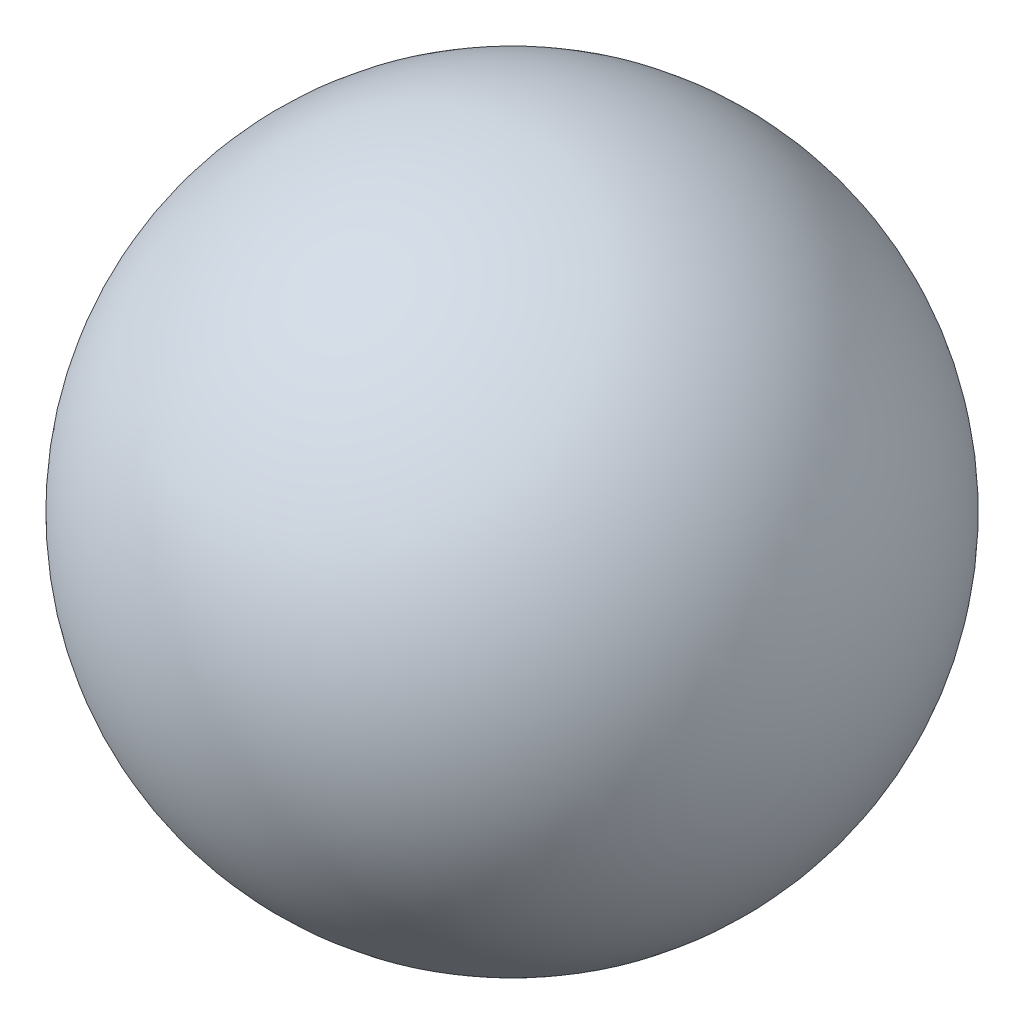
ISO-10303-21;
HEADER;
FILE_DESCRIPTION(('STEP AP214'),'2;1');
FILE_NAME('part.step','',(''),(''),'','','');
FILE_SCHEMA(('AUTOMOTIVE_DESIGN { 1 0 10303 214 1 1 1 1 }'));
ENDSEC;
DATA;
#1=APPLICATION_CONTEXT('core data for automotive mechanical design processes');
#2=APPLICATION_PROTOCOL_DEFINITION('international standard','automotive_design',2000,#1);
#3=PRODUCT_CONTEXT('',#1,'mechanical');
#4=PRODUCT('Part','Part','',(#3));
#5=PRODUCT_RELATED_PRODUCT_CATEGORY('part','',(#4));
#6=PRODUCT_DEFINITION_FORMATION('','',#4);
#7=PRODUCT_DEFINITION_CONTEXT('part definition',#1,'design');
#8=PRODUCT_DEFINITION('design','',#6,#7);
#9=PRODUCT_DEFINITION_SHAPE('','',#8);
#10=(LENGTH_UNIT() NAMED_UNIT(*) SI_UNIT(.MILLI.,.METRE.));
#11=(NAMED_UNIT(*) PLANE_ANGLE_UNIT() SI_UNIT($,.RADIAN.));
#12=(NAMED_UNIT(*) SI_UNIT($,.STERADIAN.) SOLID_ANGLE_UNIT());
#13=UNCERTAINTY_MEASURE_WITH_UNIT(LENGTH_MEASURE(1.E-05),#10,'distance_accuracy_value','');
#14=(GEOMETRIC_REPRESENTATION_CONTEXT(3) GLOBAL_UNCERTAINTY_ASSIGNED_CONTEXT((#13)) GLOBAL_UNIT_ASSIGNED_CONTEXT((#10,
#11,#12)) REPRESENTATION_CONTEXT('',''));
#15=CARTESIAN_POINT('',(0.,0.,0.));
#16=DIRECTION('',(0.,0.,1.));
#17=DIRECTION('',(1.,0.,0.));
#18=AXIS2_PLACEMENT_3D('',#15,#16,#17);
#19=CARTESIAN_POINT('',(0.,0.,0.));
#20=DIRECTION('',(0.,-1.,0.));
#21=DIRECTION('',(0.,0.,1.));
#22=AXIS2_PLACEMENT_3D('',#19,#20,#21);
#23=SPHERICAL_SURFACE('',#22,18.);
#24=CARTESIAN_POINT('',(0.,-18.,0.));
#25=VERTEX_POINT('',#24);
#26=VERTEX_LOOP('',#25);
#27=FACE_BOUND('',#26,.T.);
#28=ADVANCED_FACE('F35',(#27),#23,.T.);
#29=CLOSED_SHELL('',(#28));
#30=MANIFOLD_SOLID_BREP('B2',#29);
#31=ADVANCED_BREP_SHAPE_REPRESENTATION('',(#18,#30),#14);
#32=SHAPE_DEFINITION_REPRESENTATION(#9,#31);
ENDSEC;
END-ISO-10303-21;
